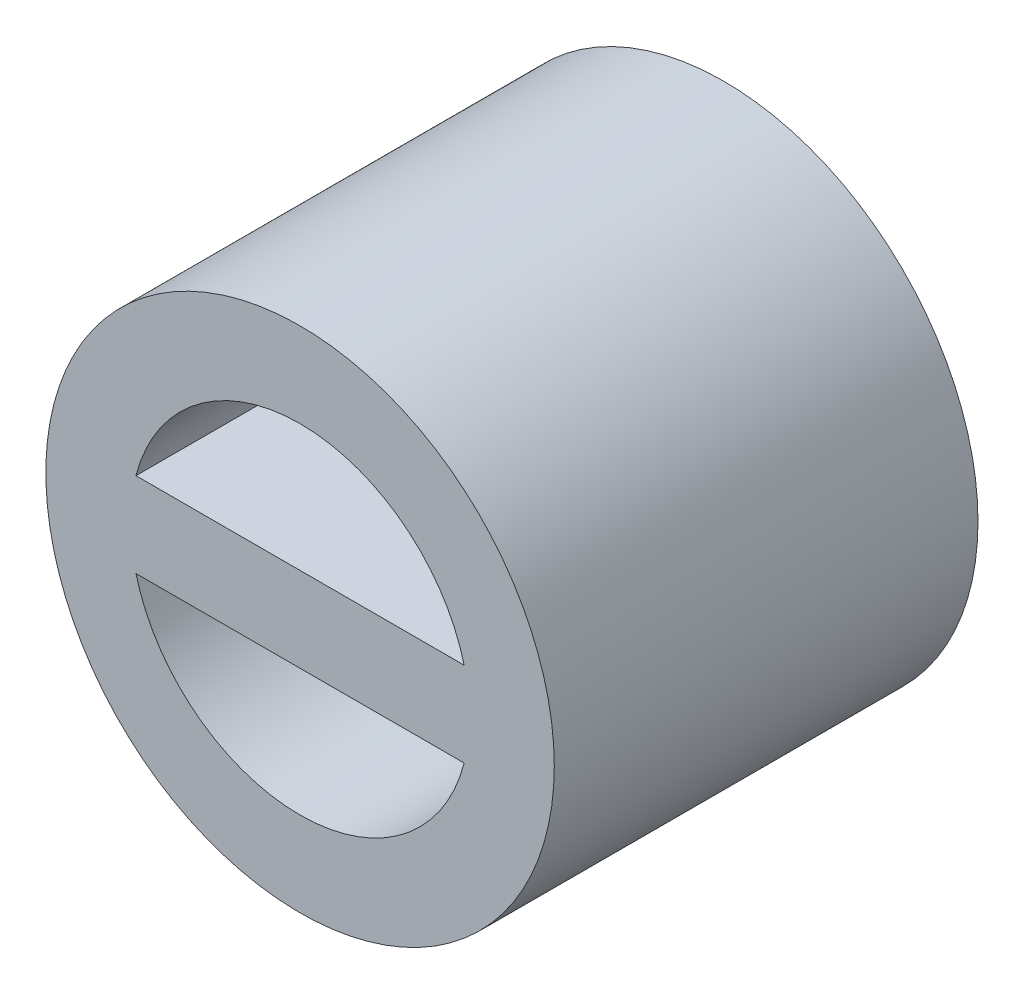
ISO-10303-21;
HEADER;
FILE_DESCRIPTION(('STEP AP214'),'2;1');
FILE_NAME('part.step','',(''),(''),'','','');
FILE_SCHEMA(('AUTOMOTIVE_DESIGN { 1 0 10303 214 1 1 1 1 }'));
ENDSEC;
DATA;
#1=APPLICATION_CONTEXT('core data for automotive mechanical design processes');
#2=APPLICATION_PROTOCOL_DEFINITION('international standard','automotive_design',2000,#1);
#3=PRODUCT_CONTEXT('',#1,'mechanical');
#4=PRODUCT('Part','Part','',(#3));
#5=PRODUCT_RELATED_PRODUCT_CATEGORY('part','',(#4));
#6=PRODUCT_DEFINITION_FORMATION('','',#4);
#7=PRODUCT_DEFINITION_CONTEXT('part definition',#1,'design');
#8=PRODUCT_DEFINITION('design','',#6,#7);
#9=PRODUCT_DEFINITION_SHAPE('','',#8);
#10=(LENGTH_UNIT() NAMED_UNIT(*) SI_UNIT(.MILLI.,.METRE.));
#11=(NAMED_UNIT(*) PLANE_ANGLE_UNIT() SI_UNIT($,.RADIAN.));
#12=(NAMED_UNIT(*) SI_UNIT($,.STERADIAN.) SOLID_ANGLE_UNIT());
#13=UNCERTAINTY_MEASURE_WITH_UNIT(LENGTH_MEASURE(1.E-05),#10,'distance_accuracy_value','');
#14=(GEOMETRIC_REPRESENTATION_CONTEXT(3) GLOBAL_UNCERTAINTY_ASSIGNED_CONTEXT((#13)) GLOBAL_UNIT_ASSIGNED_CONTEXT((#10,
#11,#12)) REPRESENTATION_CONTEXT('',''));
#15=CARTESIAN_POINT('',(0.,0.,0.));
#16=DIRECTION('',(0.,0.,1.));
#17=DIRECTION('',(1.,0.,0.));
#18=AXIS2_PLACEMENT_3D('',#15,#16,#17);
#19=CARTESIAN_POINT('',(0.,23.0322572976377,-98.999691437051));
#20=DIRECTION('',(0.,0.,1.));
#21=DIRECTION('',(1.,0.,0.));
#22=AXIS2_PLACEMENT_3D('',#19,#20,#21);
#23=PLANE('',#22);
#24=CARTESIAN_POINT('',(-7.5,15.,-98.999691437051));
#25=DIRECTION('',(0.,0.,1.));
#26=DIRECTION('',(1.,0.,0.));
#27=AXIS2_PLACEMENT_3D('',#24,#25,#26);
#28=CIRCLE('',#27,2.);
#29=CARTESIAN_POINT('',(-5.5,15.,-98.999691437051));
#30=VERTEX_POINT('',#29);
#31=EDGE_CURVE('E100',#30,#30,#28,.F.);
#32=ORIENTED_EDGE('',*,*,#31,.F.);
#33=EDGE_LOOP('',(#32));
#34=FACE_BOUND('',#33,.T.);
#35=CARTESIAN_POINT('',(-7.5,15.,-98.999691437051));
#36=DIRECTION('',(0.,0.,1.));
#37=DIRECTION('',(1.,0.,0.));
#38=AXIS2_PLACEMENT_3D('',#35,#36,#37);
#39=CIRCLE('',#38,3.);
#40=CARTESIAN_POINT('',(-4.5,15.,-98.999691437051));
#41=VERTEX_POINT('',#40);
#42=EDGE_CURVE('E39',#41,#41,#39,.T.);
#43=ORIENTED_EDGE('',*,*,#42,.F.);
#44=EDGE_LOOP('',(#43));
#45=FACE_BOUND('',#44,.T.);
#46=ADVANCED_FACE('F36',(#34,#45),#23,.F.);
#47=CARTESIAN_POINT('',(-7.5,15.,-93.999691437051));
#48=DIRECTION('',(0.,0.,1.));
#49=DIRECTION('',(1.,0.,0.));
#50=AXIS2_PLACEMENT_3D('',#47,#48,#49);
#51=PLANE('',#50);
#52=CARTESIAN_POINT('',(-7.5,15.,-93.999691437051));
#53=DIRECTION('',(0.,0.,1.));
#54=DIRECTION('',(1.,0.,0.));
#55=AXIS2_PLACEMENT_3D('',#52,#53,#54);
#56=CIRCLE('',#55,2.);
#57=CARTESIAN_POINT('',(-9.43649167310371,14.5,-93.999691437051));
#58=VERTEX_POINT('',#57);
#59=CARTESIAN_POINT('',(-5.56350832689629,14.5,-93.999691437051));
#60=VERTEX_POINT('',#59);
#61=EDGE_CURVE('E88',#58,#60,#56,.T.);
#62=ORIENTED_EDGE('',*,*,#61,.F.);
#63=DIRECTION('',(1.,0.,0.));
#64=VECTOR('',#63,1.);
#65=CARTESIAN_POINT('',(-5.56350832689629,14.5,-93.999691437051));
#66=LINE('',#65,#64);
#67=EDGE_CURVE('E11',#58,#60,#66,.T.);
#68=ORIENTED_EDGE('',*,*,#67,.T.);
#69=EDGE_LOOP('',(#62,#68));
#70=FACE_BOUND('',#69,.T.);
#71=CARTESIAN_POINT('',(-7.5,15.,-93.999691437051));
#72=DIRECTION('',(0.,0.,1.));
#73=DIRECTION('',(1.,0.,0.));
#74=AXIS2_PLACEMENT_3D('',#71,#72,#73);
#75=CIRCLE('',#74,3.);
#76=CARTESIAN_POINT('',(-4.5,15.,-93.999691437051));
#77=VERTEX_POINT('',#76);
#78=EDGE_CURVE('E102',#77,#77,#75,.T.);
#79=ORIENTED_EDGE('',*,*,#78,.T.);
#80=EDGE_LOOP('',(#79));
#81=FACE_BOUND('',#80,.T.);
#82=CARTESIAN_POINT('',(-5.56350832689629,15.5,-93.999691437051));
#83=VERTEX_POINT('',#82);
#84=CARTESIAN_POINT('',(-9.43649167310371,15.5,-93.999691437051));
#85=VERTEX_POINT('',#84);
#86=EDGE_CURVE('E109',#83,#85,#56,.T.);
#87=ORIENTED_EDGE('',*,*,#86,.F.);
#88=DIRECTION('',(-1.,0.,0.));
#89=VECTOR('',#88,1.);
#90=CARTESIAN_POINT('',(-9.43649167310371,15.5,-93.999691437051));
#91=LINE('',#90,#89);
#92=EDGE_CURVE('E44',#83,#85,#91,.T.);
#93=ORIENTED_EDGE('',*,*,#92,.T.);
#94=EDGE_LOOP('',(#87,#93));
#95=FACE_BOUND('',#94,.T.);
#96=ADVANCED_FACE('F119',(#70,#81,#95),#51,.T.);
#97=CARTESIAN_POINT('',(-5.56350832689629,14.5,-103.122797062669));
#98=DIRECTION('',(0.,-1.,0.));
#99=DIRECTION('',(0.,0.,-1.));
#100=AXIS2_PLACEMENT_3D('',#97,#98,#99);
#101=PLANE('',#100);
#102=DIRECTION('',(-1.,0.,0.));
#103=VECTOR('',#102,1.);
#104=CARTESIAN_POINT('',(-5.56350832689629,14.5,-96.499691437051));
#105=LINE('',#104,#103);
#106=CARTESIAN_POINT('',(-5.56350832689629,14.5,-96.499691437051));
#107=VERTEX_POINT('',#106);
#108=CARTESIAN_POINT('',(-9.43649167310371,14.5,-96.499691437051));
#109=VERTEX_POINT('',#108);
#110=EDGE_CURVE('E75',#107,#109,#105,.T.);
#111=ORIENTED_EDGE('',*,*,#110,.F.);
#112=DIRECTION('',(0.,0.,1.));
#113=VECTOR('',#112,1.);
#114=CARTESIAN_POINT('',(-5.56350832689629,14.5,-103.122797062669));
#115=LINE('',#114,#113);
#116=EDGE_CURVE('E55',#107,#60,#115,.T.);
#117=ORIENTED_EDGE('',*,*,#116,.T.);
#118=ORIENTED_EDGE('',*,*,#67,.F.);
#119=DIRECTION('',(0.,0.,1.));
#120=VECTOR('',#119,1.);
#121=CARTESIAN_POINT('',(-9.43649167310371,14.5,-103.122797062669));
#122=LINE('',#121,#120);
#123=EDGE_CURVE('E72',#109,#58,#122,.T.);
#124=ORIENTED_EDGE('',*,*,#123,.F.);
#125=EDGE_LOOP('',(#111,#117,#118,#124));
#126=FACE_BOUND('',#125,.T.);
#127=ADVANCED_FACE('F74',(#126),#101,.T.);
#128=CARTESIAN_POINT('',(-19.3090792980731,-59.1911110560317,-96.499691437051));
#129=DIRECTION('',(0.,0.,1.));
#130=DIRECTION('',(1.,0.,0.));
#131=AXIS2_PLACEMENT_3D('',#128,#129,#130);
#132=PLANE('',#131);
#133=CARTESIAN_POINT('',(-7.5,15.,-96.499691437051));
#134=DIRECTION('',(0.,0.,1.));
#135=DIRECTION('',(1.,0.,0.));
#136=AXIS2_PLACEMENT_3D('',#133,#134,#135);
#137=CIRCLE('',#136,2.);
#138=CARTESIAN_POINT('',(-9.43649167310371,15.5,-96.499691437051));
#139=VERTEX_POINT('',#138);
#140=EDGE_CURVE('E84',#109,#139,#137,.F.);
#141=ORIENTED_EDGE('',*,*,#140,.T.);
#142=DIRECTION('',(1.,0.,0.));
#143=VECTOR('',#142,1.);
#144=CARTESIAN_POINT('',(-9.43649167310371,15.5,-96.499691437051));
#145=LINE('',#144,#143);
#146=CARTESIAN_POINT('',(-5.56350832689629,15.5,-96.499691437051));
#147=VERTEX_POINT('',#146);
#148=EDGE_CURVE('E95',#139,#147,#145,.T.);
#149=ORIENTED_EDGE('',*,*,#148,.T.);
#150=CARTESIAN_POINT('',(-7.5,15.,-96.499691437051));
#151=DIRECTION('',(0.,0.,1.));
#152=DIRECTION('',(1.,0.,0.));
#153=AXIS2_PLACEMENT_3D('',#150,#151,#152);
#154=CIRCLE('',#153,2.);
#155=EDGE_CURVE('E87',#147,#107,#154,.F.);
#156=ORIENTED_EDGE('',*,*,#155,.T.);
#157=ORIENTED_EDGE('',*,*,#110,.T.);
#158=EDGE_LOOP('',(#141,#149,#156,#157));
#159=FACE_BOUND('',#158,.T.);
#160=ADVANCED_FACE('F82',(#159),#132,.F.);
#161=CARTESIAN_POINT('',(-9.43649167310371,15.5,-103.122797062669));
#162=DIRECTION('',(0.,1.,0.));
#163=DIRECTION('',(0.,0.,1.));
#164=AXIS2_PLACEMENT_3D('',#161,#162,#163);
#165=PLANE('',#164);
#166=ORIENTED_EDGE('',*,*,#148,.F.);
#167=DIRECTION('',(0.,0.,1.));
#168=VECTOR('',#167,1.);
#169=CARTESIAN_POINT('',(-9.43649167310371,15.5,-103.122797062669));
#170=LINE('',#169,#168);
#171=EDGE_CURVE('E94',#139,#85,#170,.T.);
#172=ORIENTED_EDGE('',*,*,#171,.T.);
#173=ORIENTED_EDGE('',*,*,#92,.F.);
#174=DIRECTION('',(0.,0.,1.));
#175=VECTOR('',#174,1.);
#176=CARTESIAN_POINT('',(-5.56350832689629,15.5,-103.122797062669));
#177=LINE('',#176,#175);
#178=EDGE_CURVE('E113',#147,#83,#177,.T.);
#179=ORIENTED_EDGE('',*,*,#178,.F.);
#180=EDGE_LOOP('',(#166,#172,#173,#179));
#181=FACE_BOUND('',#180,.T.);
#182=ADVANCED_FACE('F121',(#181),#165,.T.);
#183=CARTESIAN_POINT('',(-7.5,15.,-93.999691437051));
#184=DIRECTION('',(0.,0.,-1.));
#185=DIRECTION('',(-1.,0.,0.));
#186=AXIS2_PLACEMENT_3D('',#183,#184,#185);
#187=CYLINDRICAL_SURFACE('',#186,2.);
#188=ORIENTED_EDGE('',*,*,#171,.F.);
#189=ORIENTED_EDGE('',*,*,#140,.F.);
#190=ORIENTED_EDGE('',*,*,#123,.T.);
#191=ORIENTED_EDGE('',*,*,#61,.T.);
#192=ORIENTED_EDGE('',*,*,#116,.F.);
#193=ORIENTED_EDGE('',*,*,#155,.F.);
#194=ORIENTED_EDGE('',*,*,#178,.T.);
#195=ORIENTED_EDGE('',*,*,#86,.T.);
#196=EDGE_LOOP('',(#188,#189,#190,#191,#192,#193,#194,#195));
#197=FACE_BOUND('',#196,.T.);
#198=ORIENTED_EDGE('',*,*,#31,.T.);
#199=EDGE_LOOP('',(#198));
#200=FACE_BOUND('',#199,.T.);
#201=ADVANCED_FACE('F91',(#197,#200),#187,.F.);
#202=CARTESIAN_POINT('',(-7.5,15.,-93.999691437051));
#203=DIRECTION('',(0.,0.,-1.));
#204=DIRECTION('',(-1.,0.,0.));
#205=AXIS2_PLACEMENT_3D('',#202,#203,#204);
#206=CYLINDRICAL_SURFACE('',#205,3.);
#207=ORIENTED_EDGE('',*,*,#78,.F.);
#208=EDGE_LOOP('',(#207));
#209=FACE_BOUND('',#208,.T.);
#210=ORIENTED_EDGE('',*,*,#42,.T.);
#211=EDGE_LOOP('',(#210));
#212=FACE_BOUND('',#211,.T.);
#213=ADVANCED_FACE('F128',(#209,#212),#206,.T.);
#214=CLOSED_SHELL('',(#46,#96,#127,#160,#182,#201,#213));
#215=MANIFOLD_SOLID_BREP('B2',#214);
#216=ADVANCED_BREP_SHAPE_REPRESENTATION('',(#18,#215),#14);
#217=SHAPE_DEFINITION_REPRESENTATION(#9,#216);
ENDSEC;
END-ISO-10303-21;
